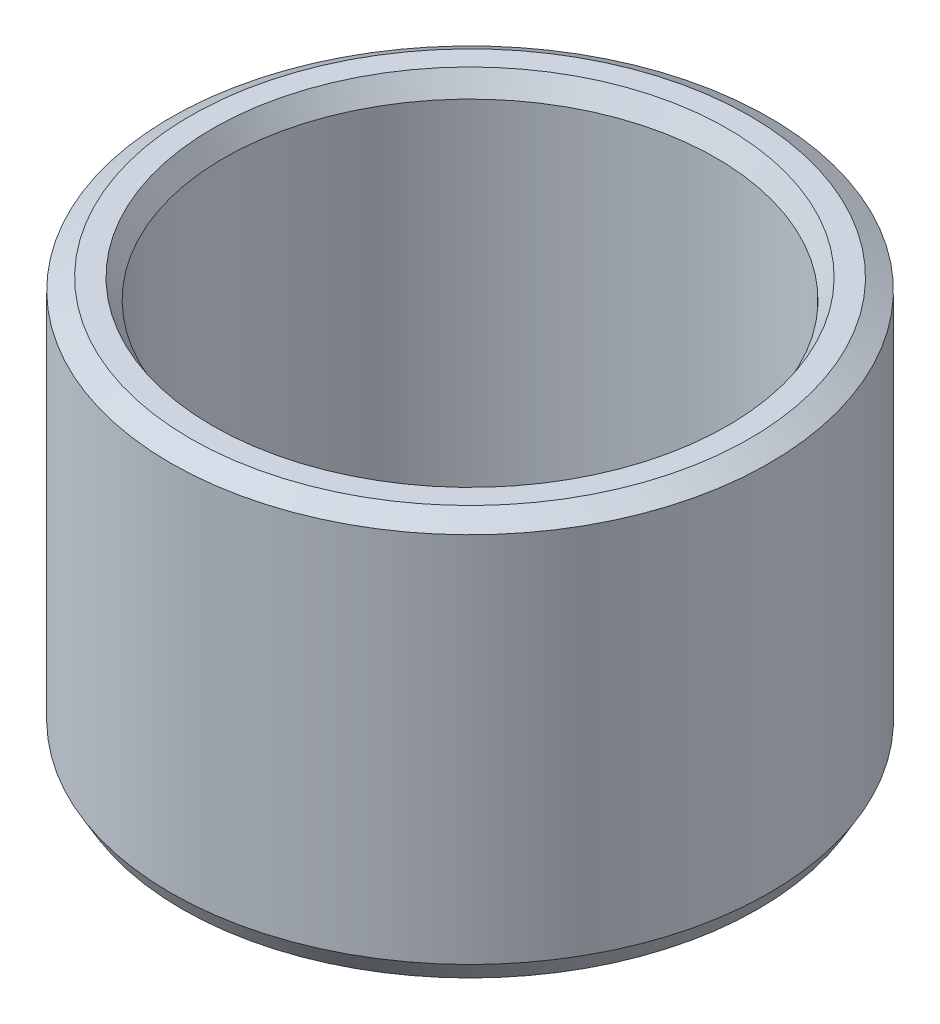
ISO-10303-21;
HEADER;
FILE_DESCRIPTION(('STEP AP214'),'2;1');
FILE_NAME('part.step','',(''),(''),'','','');
FILE_SCHEMA(('AUTOMOTIVE_DESIGN { 1 0 10303 214 1 1 1 1 }'));
ENDSEC;
DATA;
#1=APPLICATION_CONTEXT('core data for automotive mechanical design processes');
#2=APPLICATION_PROTOCOL_DEFINITION('international standard','automotive_design',2000,#1);
#3=PRODUCT_CONTEXT('',#1,'mechanical');
#4=PRODUCT('Part','Part','',(#3));
#5=PRODUCT_RELATED_PRODUCT_CATEGORY('part','',(#4));
#6=PRODUCT_DEFINITION_FORMATION('','',#4);
#7=PRODUCT_DEFINITION_CONTEXT('part definition',#1,'design');
#8=PRODUCT_DEFINITION('design','',#6,#7);
#9=PRODUCT_DEFINITION_SHAPE('','',#8);
#10=(LENGTH_UNIT() NAMED_UNIT(*) SI_UNIT(.MILLI.,.METRE.));
#11=(NAMED_UNIT(*) PLANE_ANGLE_UNIT() SI_UNIT($,.RADIAN.));
#12=(NAMED_UNIT(*) SI_UNIT($,.STERADIAN.) SOLID_ANGLE_UNIT());
#13=UNCERTAINTY_MEASURE_WITH_UNIT(LENGTH_MEASURE(1.E-05),#10,'distance_accuracy_value','');
#14=(GEOMETRIC_REPRESENTATION_CONTEXT(3) GLOBAL_UNCERTAINTY_ASSIGNED_CONTEXT((#13)) GLOBAL_UNIT_ASSIGNED_CONTEXT((#10,
#11,#12)) REPRESENTATION_CONTEXT('',''));
#15=CARTESIAN_POINT('',(0.,0.,0.));
#16=DIRECTION('',(0.,0.,1.));
#17=DIRECTION('',(1.,0.,0.));
#18=AXIS2_PLACEMENT_3D('',#15,#16,#17);
#19=CARTESIAN_POINT('',(0.,67.3587700530264,0.));
#20=DIRECTION('',(0.,-1.,0.));
#21=DIRECTION('',(0.,0.,-1.));
#22=AXIS2_PLACEMENT_3D('',#19,#20,#21);
#23=CYLINDRICAL_SURFACE('',#22,50.);
#24=CARTESIAN_POINT('',(0.,3.29648414816178,0.));
#25=DIRECTION('',(0.,1.,0.));
#26=DIRECTION('',(0.,0.,1.));
#27=AXIS2_PLACEMENT_3D('',#24,#25,#26);
#28=CIRCLE('',#27,50.);
#29=CARTESIAN_POINT('',(0.,3.29648414816178,50.));
#30=VERTEX_POINT('',#29);
#31=EDGE_CURVE('E10',#30,#30,#28,.T.);
#32=ORIENTED_EDGE('',*,*,#31,.T.);
#33=EDGE_LOOP('',(#32));
#34=FACE_BOUND('',#33,.T.);
#35=CARTESIAN_POINT('',(0.,65.4555440427059,0.));
#36=DIRECTION('',(0.,1.,0.));
#37=DIRECTION('',(0.,0.,1.));
#38=AXIS2_PLACEMENT_3D('',#35,#36,#37);
#39=CIRCLE('',#38,50.);
#40=CARTESIAN_POINT('',(0.,65.4555440427059,50.));
#41=VERTEX_POINT('',#40);
#42=EDGE_CURVE('E50',#41,#41,#39,.F.);
#43=ORIENTED_EDGE('',*,*,#42,.T.);
#44=EDGE_LOOP('',(#43));
#45=FACE_BOUND('',#44,.T.);
#46=ADVANCED_FACE('F39',(#34,#45),#23,.T.);
#47=CARTESIAN_POINT('',(0.,67.3587700530264,0.));
#48=DIRECTION('',(0.,1.,0.));
#49=DIRECTION('',(0.,0.,1.));
#50=AXIS2_PLACEMENT_3D('',#47,#48,#49);
#51=PLANE('',#50);
#52=CARTESIAN_POINT('',(0.,67.3587700530264,0.));
#53=DIRECTION('',(0.,1.,0.));
#54=DIRECTION('',(0.,0.,1.));
#55=AXIS2_PLACEMENT_3D('',#52,#53,#54);
#56=CIRCLE('',#55,43.0002568771141);
#57=CARTESIAN_POINT('',(0.,67.3587700530264,43.0002568771141));
#58=VERTEX_POINT('',#57);
#59=EDGE_CURVE('E58',#58,#58,#56,.F.);
#60=ORIENTED_EDGE('',*,*,#59,.T.);
#61=EDGE_LOOP('',(#60));
#62=FACE_BOUND('',#61,.T.);
#63=CARTESIAN_POINT('',(0.,67.3587700530264,0.));
#64=DIRECTION('',(0.,1.,0.));
#65=DIRECTION('',(0.,0.,1.));
#66=AXIS2_PLACEMENT_3D('',#63,#64,#65);
#67=CIRCLE('',#66,46.7035158518382);
#68=CARTESIAN_POINT('',(0.,67.3587700530264,46.7035158518382));
#69=VERTEX_POINT('',#68);
#70=EDGE_CURVE('E61',#69,#69,#67,.T.);
#71=ORIENTED_EDGE('',*,*,#70,.T.);
#72=EDGE_LOOP('',(#71));
#73=FACE_BOUND('',#72,.T.);
#74=ADVANCED_FACE('F88',(#62,#73),#51,.T.);
#75=CARTESIAN_POINT('',(0.,0.,0.));
#76=DIRECTION('',(0.,1.,0.));
#77=DIRECTION('',(0.,0.,1.));
#78=AXIS2_PLACEMENT_3D('',#75,#76,#77);
#79=PLANE('',#78);
#80=CARTESIAN_POINT('',(0.,0.,0.));
#81=DIRECTION('',(0.,1.,0.));
#82=DIRECTION('',(0.,0.,1.));
#83=AXIS2_PLACEMENT_3D('',#80,#81,#82);
#84=CIRCLE('',#83,44.3935150149554);
#85=CARTESIAN_POINT('',(0.,0.,44.3935150149554));
#86=VERTEX_POINT('',#85);
#87=EDGE_CURVE('E51',#86,#86,#84,.T.);
#88=ORIENTED_EDGE('',*,*,#87,.T.);
#89=EDGE_LOOP('',(#88));
#90=FACE_BOUND('',#89,.T.);
#91=CARTESIAN_POINT('',(0.,0.,0.));
#92=DIRECTION('',(0.,1.,0.));
#93=DIRECTION('',(0.,0.,1.));
#94=AXIS2_PLACEMENT_3D('',#91,#92,#93);
#95=CIRCLE('',#94,48.0967739896794);
#96=CARTESIAN_POINT('',(0.,0.,48.0967739896794));
#97=VERTEX_POINT('',#96);
#98=EDGE_CURVE('E54',#97,#97,#95,.F.);
#99=ORIENTED_EDGE('',*,*,#98,.T.);
#100=EDGE_LOOP('',(#99));
#101=FACE_BOUND('',#100,.T.);
#102=ADVANCED_FACE('F83',(#90,#101),#79,.F.);
#103=CARTESIAN_POINT('',(0.,67.3587700530264,0.));
#104=DIRECTION('',(0.,-1.,0.));
#105=DIRECTION('',(0.,0.,-1.));
#106=AXIS2_PLACEMENT_3D('',#103,#104,#105);
#107=CYLINDRICAL_SURFACE('',#106,41.0970308667935);
#108=CARTESIAN_POINT('',(0.,64.0622859048646,0.));
#109=DIRECTION('',(0.,1.,0.));
#110=DIRECTION('',(0.,0.,1.));
#111=AXIS2_PLACEMENT_3D('',#108,#109,#110);
#112=CIRCLE('',#111,41.0970308667935);
#113=CARTESIAN_POINT('',(0.,64.0622859048646,41.0970308667935));
#114=VERTEX_POINT('',#113);
#115=EDGE_CURVE('E67',#114,#114,#112,.T.);
#116=ORIENTED_EDGE('',*,*,#115,.T.);
#117=EDGE_LOOP('',(#116));
#118=FACE_BOUND('',#117,.T.);
#119=CARTESIAN_POINT('',(0.,1.90322601032057,0.));
#120=DIRECTION('',(0.,1.,0.));
#121=DIRECTION('',(0.,0.,1.));
#122=AXIS2_PLACEMENT_3D('',#119,#120,#121);
#123=CIRCLE('',#122,41.0970308667935);
#124=CARTESIAN_POINT('',(0.,1.90322601032057,41.0970308667935));
#125=VERTEX_POINT('',#124);
#126=EDGE_CURVE('E69',#125,#125,#123,.F.);
#127=ORIENTED_EDGE('',*,*,#126,.T.);
#128=EDGE_LOOP('',(#127));
#129=FACE_BOUND('',#128,.T.);
#130=ADVANCED_FACE('F71',(#118,#129),#107,.F.);
#131=CARTESIAN_POINT('',(0.,64.0622859048646,0.));
#132=DIRECTION('',(0.,1.,0.));
#133=DIRECTION('',(0.,0.,1.));
#134=AXIS2_PLACEMENT_3D('',#131,#132,#133);
#135=CONICAL_SURFACE('',#134,41.0970308667935,0.523598775598298);
#136=ORIENTED_EDGE('',*,*,#59,.F.);
#137=EDGE_LOOP('',(#136));
#138=FACE_BOUND('',#137,.T.);
#139=ORIENTED_EDGE('',*,*,#115,.F.);
#140=EDGE_LOOP('',(#139));
#141=FACE_BOUND('',#140,.T.);
#142=ADVANCED_FACE('F77',(#138,#141),#135,.F.);
#143=CARTESIAN_POINT('',(0.,0.,0.));
#144=DIRECTION('',(0.,-1.,0.));
#145=DIRECTION('',(0.,0.,-1.));
#146=AXIS2_PLACEMENT_3D('',#143,#144,#145);
#147=CONICAL_SURFACE('',#146,44.3935150149554,1.04719755119659);
#148=ORIENTED_EDGE('',*,*,#126,.F.);
#149=EDGE_LOOP('',(#148));
#150=FACE_BOUND('',#149,.T.);
#151=ORIENTED_EDGE('',*,*,#87,.F.);
#152=EDGE_LOOP('',(#151));
#153=FACE_BOUND('',#152,.T.);
#154=ADVANCED_FACE('F73',(#150,#153),#147,.F.);
#155=CARTESIAN_POINT('',(0.,3.29648414816178,0.));
#156=DIRECTION('',(0.,1.,0.));
#157=DIRECTION('',(0.,0.,1.));
#158=AXIS2_PLACEMENT_3D('',#155,#156,#157);
#159=CONICAL_SURFACE('',#158,50.,0.523598775598302);
#160=ORIENTED_EDGE('',*,*,#98,.F.);
#161=EDGE_LOOP('',(#160));
#162=FACE_BOUND('',#161,.T.);
#163=ORIENTED_EDGE('',*,*,#31,.F.);
#164=EDGE_LOOP('',(#163));
#165=FACE_BOUND('',#164,.T.);
#166=ADVANCED_FACE('F76',(#162,#165),#159,.T.);
#167=CARTESIAN_POINT('',(0.,67.3587700530264,0.));
#168=DIRECTION('',(0.,-1.,0.));
#169=DIRECTION('',(0.,0.,-1.));
#170=AXIS2_PLACEMENT_3D('',#167,#168,#169);
#171=CONICAL_SURFACE('',#170,46.7035158518382,1.04719755119659);
#172=ORIENTED_EDGE('',*,*,#42,.F.);
#173=EDGE_LOOP('',(#172));
#174=FACE_BOUND('',#173,.T.);
#175=ORIENTED_EDGE('',*,*,#70,.F.);
#176=EDGE_LOOP('',(#175));
#177=FACE_BOUND('',#176,.T.);
#178=ADVANCED_FACE('F45',(#174,#177),#171,.T.);
#179=CLOSED_SHELL('',(#46,#74,#102,#130,#142,#154,#166,#178));
#180=MANIFOLD_SOLID_BREP('B2',#179);
#181=ADVANCED_BREP_SHAPE_REPRESENTATION('',(#18,#180),#14);
#182=SHAPE_DEFINITION_REPRESENTATION(#9,#181);
ENDSEC;
END-ISO-10303-21;
